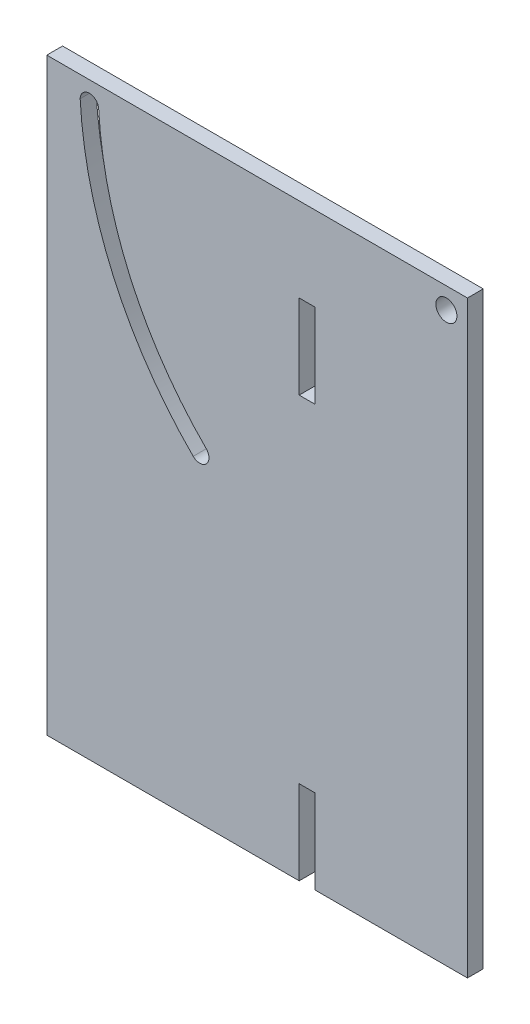
ISO-10303-21;
HEADER;
FILE_DESCRIPTION(('STEP AP214'),'2;1');
FILE_NAME('part.step','',(''),(''),'','','');
FILE_SCHEMA(('AUTOMOTIVE_DESIGN { 1 0 10303 214 1 1 1 1 }'));
ENDSEC;
DATA;
#1=APPLICATION_CONTEXT('core data for automotive mechanical design processes');
#2=APPLICATION_PROTOCOL_DEFINITION('international standard','automotive_design',2000,#1);
#3=PRODUCT_CONTEXT('',#1,'mechanical');
#4=PRODUCT('Part','Part','',(#3));
#5=PRODUCT_RELATED_PRODUCT_CATEGORY('part','',(#4));
#6=PRODUCT_DEFINITION_FORMATION('','',#4);
#7=PRODUCT_DEFINITION_CONTEXT('part definition',#1,'design');
#8=PRODUCT_DEFINITION('design','',#6,#7);
#9=PRODUCT_DEFINITION_SHAPE('','',#8);
#10=(LENGTH_UNIT() NAMED_UNIT(*) SI_UNIT(.MILLI.,.METRE.));
#11=(NAMED_UNIT(*) PLANE_ANGLE_UNIT() SI_UNIT($,.RADIAN.));
#12=(NAMED_UNIT(*) SI_UNIT($,.STERADIAN.) SOLID_ANGLE_UNIT());
#13=UNCERTAINTY_MEASURE_WITH_UNIT(LENGTH_MEASURE(1.E-05),#10,'distance_accuracy_value','');
#14=(GEOMETRIC_REPRESENTATION_CONTEXT(3) GLOBAL_UNCERTAINTY_ASSIGNED_CONTEXT((#13)) GLOBAL_UNIT_ASSIGNED_CONTEXT((#10,
#11,#12)) REPRESENTATION_CONTEXT('',''));
#15=CARTESIAN_POINT('',(0.,0.,0.));
#16=DIRECTION('',(0.,0.,1.));
#17=DIRECTION('',(1.,0.,0.));
#18=AXIS2_PLACEMENT_3D('',#15,#16,#17);
#19=CARTESIAN_POINT('',(0.,0.,4.7625));
#20=DIRECTION('',(0.,0.,-1.));
#21=DIRECTION('',(-1.,0.,0.));
#22=AXIS2_PLACEMENT_3D('',#19,#20,#21);
#23=PLANE('',#22);
#24=DIRECTION('',(0.,-1.,0.));
#25=VECTOR('',#24,1.);
#26=CARTESIAN_POINT('',(76.2,152.4,4.7625));
#27=LINE('',#26,#25);
#28=CARTESIAN_POINT('',(76.2,152.4,4.7625));
#29=VERTEX_POINT('',#28);
#30=CARTESIAN_POINT('',(76.2,127.,4.7625));
#31=VERTEX_POINT('',#30);
#32=EDGE_CURVE('E146',#29,#31,#27,.T.);
#33=ORIENTED_EDGE('',*,*,#32,.F.);
#34=DIRECTION('',(-1.,0.,0.));
#35=VECTOR('',#34,1.);
#36=CARTESIAN_POINT('',(76.2,152.4,4.7625));
#37=LINE('',#36,#35);
#38=CARTESIAN_POINT('',(80.9625,152.4,4.7625));
#39=VERTEX_POINT('',#38);
#40=EDGE_CURVE('E169',#39,#29,#37,.T.);
#41=ORIENTED_EDGE('',*,*,#40,.F.);
#42=DIRECTION('',(0.,1.,0.));
#43=VECTOR('',#42,1.);
#44=CARTESIAN_POINT('',(80.9625,152.4,4.7625));
#45=LINE('',#44,#43);
#46=CARTESIAN_POINT('',(80.9625,127.,4.7625));
#47=VERTEX_POINT('',#46);
#48=EDGE_CURVE('E167',#47,#39,#45,.T.);
#49=ORIENTED_EDGE('',*,*,#48,.F.);
#50=DIRECTION('',(1.,0.,0.));
#51=VECTOR('',#50,1.);
#52=CARTESIAN_POINT('',(76.2,127.,4.7625));
#53=LINE('',#52,#51);
#54=EDGE_CURVE('E154',#31,#47,#53,.T.);
#55=ORIENTED_EDGE('',*,*,#54,.F.);
#56=EDGE_LOOP('',(#33,#41,#49,#55));
#57=FACE_BOUND('',#56,.T.);
#58=DIRECTION('',(0.,-1.,0.));
#59=VECTOR('',#58,1.);
#60=CARTESIAN_POINT('',(0.,0.,4.7625));
#61=LINE('',#60,#59);
#62=CARTESIAN_POINT('',(0.,177.8,4.7625));
#63=VERTEX_POINT('',#62);
#64=CARTESIAN_POINT('',(0.,0.,4.7625));
#65=VERTEX_POINT('',#64);
#66=EDGE_CURVE('E216',#63,#65,#61,.T.);
#67=ORIENTED_EDGE('',*,*,#66,.T.);
#68=DIRECTION('',(1.,0.,0.));
#69=VECTOR('',#68,1.);
#70=CARTESIAN_POINT('',(0.,0.,4.7625));
#71=LINE('',#70,#69);
#72=CARTESIAN_POINT('',(76.2,0.,4.7625));
#73=VERTEX_POINT('',#72);
#74=EDGE_CURVE('E219',#65,#73,#71,.T.);
#75=ORIENTED_EDGE('',*,*,#74,.T.);
#76=DIRECTION('',(0.,1.,0.));
#77=VECTOR('',#76,1.);
#78=CARTESIAN_POINT('',(76.2,25.4,4.7625));
#79=LINE('',#78,#77);
#80=CARTESIAN_POINT('',(76.2,25.4,4.7625));
#81=VERTEX_POINT('',#80);
#82=EDGE_CURVE('E222',#73,#81,#79,.T.);
#83=ORIENTED_EDGE('',*,*,#82,.T.);
#84=DIRECTION('',(1.,0.,0.));
#85=VECTOR('',#84,1.);
#86=CARTESIAN_POINT('',(76.2,25.4,4.7625));
#87=LINE('',#86,#85);
#88=CARTESIAN_POINT('',(80.9625,25.4,4.7625));
#89=VERTEX_POINT('',#88);
#90=EDGE_CURVE('E224',#81,#89,#87,.T.);
#91=ORIENTED_EDGE('',*,*,#90,.T.);
#92=DIRECTION('',(0.,-1.,0.));
#93=VECTOR('',#92,1.);
#94=CARTESIAN_POINT('',(80.9625,25.4,4.7625));
#95=LINE('',#94,#93);
#96=CARTESIAN_POINT('',(80.9625,0.,4.7625));
#97=VERTEX_POINT('',#96);
#98=EDGE_CURVE('E226',#89,#97,#95,.T.);
#99=ORIENTED_EDGE('',*,*,#98,.T.);
#100=DIRECTION('',(1.,0.,0.));
#101=VECTOR('',#100,1.);
#102=CARTESIAN_POINT('',(80.9625,0.,4.7625));
#103=LINE('',#102,#101);
#104=CARTESIAN_POINT('',(127.,0.,4.7625));
#105=VERTEX_POINT('',#104);
#106=EDGE_CURVE('E228',#97,#105,#103,.T.);
#107=ORIENTED_EDGE('',*,*,#106,.T.);
#108=DIRECTION('',(0.,1.,0.));
#109=VECTOR('',#108,1.);
#110=CARTESIAN_POINT('',(127.,0.,4.7625));
#111=LINE('',#110,#109);
#112=CARTESIAN_POINT('',(127.,177.8,4.7625));
#113=VERTEX_POINT('',#112);
#114=EDGE_CURVE('E230',#105,#113,#111,.T.);
#115=ORIENTED_EDGE('',*,*,#114,.T.);
#116=DIRECTION('',(-1.,0.,0.));
#117=VECTOR('',#116,1.);
#118=CARTESIAN_POINT('',(0.,177.8,4.7625));
#119=LINE('',#118,#117);
#120=EDGE_CURVE('E232',#113,#63,#119,.T.);
#121=ORIENTED_EDGE('',*,*,#120,.T.);
#122=EDGE_LOOP('',(#67,#75,#83,#91,#99,#107,#115,#121));
#123=FACE_BOUND('',#122,.T.);
#124=CARTESIAN_POINT('',(12.8766311532659,171.45,4.7625));
#125=DIRECTION('',(0.,0.,1.));
#126=DIRECTION('',(1.,0.,0.));
#127=AXIS2_PLACEMENT_3D('',#124,#125,#126);
#128=CIRCLE('',#127,2.79832433293209);
#129=CARTESIAN_POINT('',(15.674955486198,171.45,4.7625));
#130=VERTEX_POINT('',#129);
#131=CARTESIAN_POINT('',(10.0783068203338,171.45,4.7625));
#132=VERTEX_POINT('',#131);
#133=EDGE_CURVE('E185',#130,#132,#128,.T.);
#134=ORIENTED_EDGE('',*,*,#133,.F.);
#135=CARTESIAN_POINT('',(127.,177.8,4.7625));
#136=DIRECTION('',(0.,0.,-1.));
#137=DIRECTION('',(1.,0.,0.));
#138=AXIS2_PLACEMENT_3D('',#135,#136,#137);
#139=CIRCLE('',#138,111.506);
#140=CARTESIAN_POINT('',(48.1533512570128,98.9533512570128,4.7625));
#141=VERTEX_POINT('',#140);
#142=EDGE_CURVE('E193',#141,#130,#139,.T.);
#143=ORIENTED_EDGE('',*,*,#142,.F.);
#144=CARTESIAN_POINT('',(46.1776949103776,96.9776949103776,4.7625));
#145=DIRECTION('',(0.,0.,1.));
#146=DIRECTION('',(-1.,0.,0.));
#147=AXIS2_PLACEMENT_3D('',#144,#145,#146);
#148=CIRCLE('',#147,2.794);
#149=CARTESIAN_POINT('',(44.2020385637424,95.0020385637424,4.7625));
#150=VERTEX_POINT('',#149);
#151=EDGE_CURVE('E190',#150,#141,#148,.T.);
#152=ORIENTED_EDGE('',*,*,#151,.F.);
#153=CARTESIAN_POINT('',(127.,177.8,4.7625));
#154=DIRECTION('',(0.,0.,1.));
#155=DIRECTION('',(1.,0.,0.));
#156=AXIS2_PLACEMENT_3D('',#153,#154,#155);
#157=CIRCLE('',#156,117.094);
#158=EDGE_CURVE('E187',#132,#150,#157,.T.);
#159=ORIENTED_EDGE('',*,*,#158,.F.);
#160=EDGE_LOOP('',(#134,#143,#152,#159));
#161=FACE_BOUND('',#160,.T.);
#162=CARTESIAN_POINT('',(120.65,171.45,4.7625));
#163=DIRECTION('',(0.,0.,1.));
#164=DIRECTION('',(1.,0.,0.));
#165=AXIS2_PLACEMENT_3D('',#162,#163,#164);
#166=CIRCLE('',#165,3.175);
#167=CARTESIAN_POINT('',(123.825,171.45,4.7625));
#168=VERTEX_POINT('',#167);
#169=EDGE_CURVE('E175',#168,#168,#166,.T.);
#170=ORIENTED_EDGE('',*,*,#169,.F.);
#171=EDGE_LOOP('',(#170));
#172=FACE_BOUND('',#171,.T.);
#173=ADVANCED_FACE('F33',(#57,#123,#161,#172),#23,.F.);
#174=CARTESIAN_POINT('',(0.,0.,0.));
#175=DIRECTION('',(0.,0.,-1.));
#176=DIRECTION('',(-1.,0.,0.));
#177=AXIS2_PLACEMENT_3D('',#174,#175,#176);
#178=PLANE('',#177);
#179=DIRECTION('',(-1.,0.,0.));
#180=VECTOR('',#179,1.);
#181=CARTESIAN_POINT('',(76.2,152.4,0.));
#182=LINE('',#181,#180);
#183=CARTESIAN_POINT('',(80.9625,152.4,0.));
#184=VERTEX_POINT('',#183);
#185=CARTESIAN_POINT('',(76.2,152.4,0.));
#186=VERTEX_POINT('',#185);
#187=EDGE_CURVE('E155',#184,#186,#182,.T.);
#188=ORIENTED_EDGE('',*,*,#187,.T.);
#189=DIRECTION('',(0.,-1.,0.));
#190=VECTOR('',#189,1.);
#191=CARTESIAN_POINT('',(76.2,152.4,0.));
#192=LINE('',#191,#190);
#193=CARTESIAN_POINT('',(76.2,127.,0.));
#194=VERTEX_POINT('',#193);
#195=EDGE_CURVE('E56',#186,#194,#192,.T.);
#196=ORIENTED_EDGE('',*,*,#195,.T.);
#197=DIRECTION('',(1.,0.,0.));
#198=VECTOR('',#197,1.);
#199=CARTESIAN_POINT('',(76.2,127.,0.));
#200=LINE('',#199,#198);
#201=CARTESIAN_POINT('',(80.9625,127.,0.));
#202=VERTEX_POINT('',#201);
#203=EDGE_CURVE('E161',#194,#202,#200,.T.);
#204=ORIENTED_EDGE('',*,*,#203,.T.);
#205=DIRECTION('',(0.,1.,0.));
#206=VECTOR('',#205,1.);
#207=CARTESIAN_POINT('',(80.9625,152.4,0.));
#208=LINE('',#207,#206);
#209=EDGE_CURVE('E177',#202,#184,#208,.T.);
#210=ORIENTED_EDGE('',*,*,#209,.T.);
#211=EDGE_LOOP('',(#188,#196,#204,#210));
#212=FACE_BOUND('',#211,.T.);
#213=DIRECTION('',(0.,-1.,0.));
#214=VECTOR('',#213,1.);
#215=CARTESIAN_POINT('',(0.,0.,0.));
#216=LINE('',#215,#214);
#217=CARTESIAN_POINT('',(0.,177.8,0.));
#218=VERTEX_POINT('',#217);
#219=CARTESIAN_POINT('',(0.,0.,0.));
#220=VERTEX_POINT('',#219);
#221=EDGE_CURVE('E215',#218,#220,#216,.T.);
#222=ORIENTED_EDGE('',*,*,#221,.F.);
#223=DIRECTION('',(-1.,0.,0.));
#224=VECTOR('',#223,1.);
#225=CARTESIAN_POINT('',(0.,177.8,0.));
#226=LINE('',#225,#224);
#227=CARTESIAN_POINT('',(127.,177.8,0.));
#228=VERTEX_POINT('',#227);
#229=EDGE_CURVE('E220',#228,#218,#226,.T.);
#230=ORIENTED_EDGE('',*,*,#229,.F.);
#231=DIRECTION('',(0.,1.,0.));
#232=VECTOR('',#231,1.);
#233=CARTESIAN_POINT('',(127.,0.,0.));
#234=LINE('',#233,#232);
#235=CARTESIAN_POINT('',(127.,0.,0.));
#236=VERTEX_POINT('',#235);
#237=EDGE_CURVE('E247',#236,#228,#234,.T.);
#238=ORIENTED_EDGE('',*,*,#237,.F.);
#239=DIRECTION('',(1.,0.,0.));
#240=VECTOR('',#239,1.);
#241=CARTESIAN_POINT('',(80.9625,0.,0.));
#242=LINE('',#241,#240);
#243=CARTESIAN_POINT('',(80.9625,0.,0.));
#244=VERTEX_POINT('',#243);
#245=EDGE_CURVE('E245',#244,#236,#242,.T.);
#246=ORIENTED_EDGE('',*,*,#245,.F.);
#247=DIRECTION('',(0.,-1.,0.));
#248=VECTOR('',#247,1.);
#249=CARTESIAN_POINT('',(80.9625,25.4,0.));
#250=LINE('',#249,#248);
#251=CARTESIAN_POINT('',(80.9625,25.4,0.));
#252=VERTEX_POINT('',#251);
#253=EDGE_CURVE('E243',#252,#244,#250,.T.);
#254=ORIENTED_EDGE('',*,*,#253,.F.);
#255=DIRECTION('',(1.,0.,0.));
#256=VECTOR('',#255,1.);
#257=CARTESIAN_POINT('',(76.2,25.4,0.));
#258=LINE('',#257,#256);
#259=CARTESIAN_POINT('',(76.2,25.4,0.));
#260=VERTEX_POINT('',#259);
#261=EDGE_CURVE('E241',#260,#252,#258,.T.);
#262=ORIENTED_EDGE('',*,*,#261,.F.);
#263=DIRECTION('',(0.,1.,0.));
#264=VECTOR('',#263,1.);
#265=CARTESIAN_POINT('',(76.2,25.4,0.));
#266=LINE('',#265,#264);
#267=CARTESIAN_POINT('',(76.2,0.,0.));
#268=VERTEX_POINT('',#267);
#269=EDGE_CURVE('E239',#268,#260,#266,.T.);
#270=ORIENTED_EDGE('',*,*,#269,.F.);
#271=DIRECTION('',(1.,0.,0.));
#272=VECTOR('',#271,1.);
#273=CARTESIAN_POINT('',(0.,0.,0.));
#274=LINE('',#273,#272);
#275=EDGE_CURVE('E237',#220,#268,#274,.T.);
#276=ORIENTED_EDGE('',*,*,#275,.F.);
#277=EDGE_LOOP('',(#222,#230,#238,#246,#254,#262,#270,#276));
#278=FACE_BOUND('',#277,.T.);
#279=CARTESIAN_POINT('',(127.,177.8,0.));
#280=DIRECTION('',(0.,0.,-1.));
#281=DIRECTION('',(1.,0.,0.));
#282=AXIS2_PLACEMENT_3D('',#279,#280,#281);
#283=CIRCLE('',#282,111.506);
#284=CARTESIAN_POINT('',(48.1533512570128,98.9533512570128,0.));
#285=VERTEX_POINT('',#284);
#286=CARTESIAN_POINT('',(15.674955486198,171.45,0.));
#287=VERTEX_POINT('',#286);
#288=EDGE_CURVE('E188',#285,#287,#283,.T.);
#289=ORIENTED_EDGE('',*,*,#288,.T.);
#290=CARTESIAN_POINT('',(12.8766311532659,171.45,0.));
#291=DIRECTION('',(0.,0.,1.));
#292=DIRECTION('',(1.,0.,0.));
#293=AXIS2_PLACEMENT_3D('',#290,#291,#292);
#294=CIRCLE('',#293,2.79832433293209);
#295=CARTESIAN_POINT('',(10.0783068203338,171.45,0.));
#296=VERTEX_POINT('',#295);
#297=EDGE_CURVE('E162',#287,#296,#294,.T.);
#298=ORIENTED_EDGE('',*,*,#297,.T.);
#299=CARTESIAN_POINT('',(127.,177.8,0.));
#300=DIRECTION('',(0.,0.,1.));
#301=DIRECTION('',(1.,0.,0.));
#302=AXIS2_PLACEMENT_3D('',#299,#300,#301);
#303=CIRCLE('',#302,117.094);
#304=CARTESIAN_POINT('',(44.2020385637424,95.0020385637424,0.));
#305=VERTEX_POINT('',#304);
#306=EDGE_CURVE('E198',#296,#305,#303,.T.);
#307=ORIENTED_EDGE('',*,*,#306,.T.);
#308=CARTESIAN_POINT('',(46.1776949103776,96.9776949103776,0.));
#309=DIRECTION('',(0.,0.,1.));
#310=DIRECTION('',(-1.,0.,0.));
#311=AXIS2_PLACEMENT_3D('',#308,#309,#310);
#312=CIRCLE('',#311,2.794);
#313=EDGE_CURVE('E201',#305,#285,#312,.T.);
#314=ORIENTED_EDGE('',*,*,#313,.T.);
#315=EDGE_LOOP('',(#289,#298,#307,#314));
#316=FACE_BOUND('',#315,.T.);
#317=CARTESIAN_POINT('',(120.65,171.45,0.));
#318=DIRECTION('',(0.,0.,1.));
#319=DIRECTION('',(1.,0.,0.));
#320=AXIS2_PLACEMENT_3D('',#317,#318,#319);
#321=CIRCLE('',#320,3.175);
#322=CARTESIAN_POINT('',(123.825,171.45,0.));
#323=VERTEX_POINT('',#322);
#324=EDGE_CURVE('E355',#323,#323,#321,.T.);
#325=ORIENTED_EDGE('',*,*,#324,.T.);
#326=EDGE_LOOP('',(#325));
#327=FACE_BOUND('',#326,.T.);
#328=ADVANCED_FACE('F277',(#212,#278,#316,#327),#178,.T.);
#329=CARTESIAN_POINT('',(0.,0.,4.7625));
#330=DIRECTION('',(1.,0.,0.));
#331=DIRECTION('',(0.,0.,-1.));
#332=AXIS2_PLACEMENT_3D('',#329,#330,#331);
#333=PLANE('',#332);
#334=ORIENTED_EDGE('',*,*,#221,.T.);
#335=DIRECTION('',(0.,0.,-1.));
#336=VECTOR('',#335,1.);
#337=CARTESIAN_POINT('',(0.,0.,4.7625));
#338=LINE('',#337,#336);
#339=EDGE_CURVE('E11',#65,#220,#338,.T.);
#340=ORIENTED_EDGE('',*,*,#339,.F.);
#341=ORIENTED_EDGE('',*,*,#66,.F.);
#342=DIRECTION('',(0.,0.,-1.));
#343=VECTOR('',#342,1.);
#344=CARTESIAN_POINT('',(0.,177.8,4.7625));
#345=LINE('',#344,#343);
#346=EDGE_CURVE('E234',#63,#218,#345,.T.);
#347=ORIENTED_EDGE('',*,*,#346,.T.);
#348=EDGE_LOOP('',(#334,#340,#341,#347));
#349=FACE_BOUND('',#348,.T.);
#350=ADVANCED_FACE('F35',(#349),#333,.F.);
#351=CARTESIAN_POINT('',(0.,0.,4.7625));
#352=DIRECTION('',(0.,1.,0.));
#353=DIRECTION('',(0.,0.,1.));
#354=AXIS2_PLACEMENT_3D('',#351,#352,#353);
#355=PLANE('',#354);
#356=ORIENTED_EDGE('',*,*,#275,.T.);
#357=DIRECTION('',(0.,0.,-1.));
#358=VECTOR('',#357,1.);
#359=CARTESIAN_POINT('',(76.2,0.,4.7625));
#360=LINE('',#359,#358);
#361=EDGE_CURVE('E41',#73,#268,#360,.T.);
#362=ORIENTED_EDGE('',*,*,#361,.F.);
#363=ORIENTED_EDGE('',*,*,#74,.F.);
#364=ORIENTED_EDGE('',*,*,#339,.T.);
#365=EDGE_LOOP('',(#356,#362,#363,#364));
#366=FACE_BOUND('',#365,.T.);
#367=ADVANCED_FACE('F294',(#366),#355,.F.);
#368=CARTESIAN_POINT('',(76.2,25.4,4.7625));
#369=DIRECTION('',(-1.,0.,0.));
#370=DIRECTION('',(0.,0.,1.));
#371=AXIS2_PLACEMENT_3D('',#368,#369,#370);
#372=PLANE('',#371);
#373=ORIENTED_EDGE('',*,*,#269,.T.);
#374=DIRECTION('',(0.,0.,-1.));
#375=VECTOR('',#374,1.);
#376=CARTESIAN_POINT('',(76.2,25.4,4.7625));
#377=LINE('',#376,#375);
#378=EDGE_CURVE('E264',#81,#260,#377,.T.);
#379=ORIENTED_EDGE('',*,*,#378,.F.);
#380=ORIENTED_EDGE('',*,*,#82,.F.);
#381=ORIENTED_EDGE('',*,*,#361,.T.);
#382=EDGE_LOOP('',(#373,#379,#380,#381));
#383=FACE_BOUND('',#382,.T.);
#384=ADVANCED_FACE('F271',(#383),#372,.F.);
#385=CARTESIAN_POINT('',(76.2,25.4,4.7625));
#386=DIRECTION('',(0.,1.,0.));
#387=DIRECTION('',(0.,0.,1.));
#388=AXIS2_PLACEMENT_3D('',#385,#386,#387);
#389=PLANE('',#388);
#390=ORIENTED_EDGE('',*,*,#261,.T.);
#391=DIRECTION('',(0.,0.,-1.));
#392=VECTOR('',#391,1.);
#393=CARTESIAN_POINT('',(80.9625,25.4,4.7625));
#394=LINE('',#393,#392);
#395=EDGE_CURVE('E261',#89,#252,#394,.T.);
#396=ORIENTED_EDGE('',*,*,#395,.F.);
#397=ORIENTED_EDGE('',*,*,#90,.F.);
#398=ORIENTED_EDGE('',*,*,#378,.T.);
#399=EDGE_LOOP('',(#390,#396,#397,#398));
#400=FACE_BOUND('',#399,.T.);
#401=ADVANCED_FACE('F283',(#400),#389,.F.);
#402=CARTESIAN_POINT('',(80.9625,25.4,4.7625));
#403=DIRECTION('',(1.,0.,0.));
#404=DIRECTION('',(0.,0.,-1.));
#405=AXIS2_PLACEMENT_3D('',#402,#403,#404);
#406=PLANE('',#405);
#407=ORIENTED_EDGE('',*,*,#253,.T.);
#408=DIRECTION('',(0.,0.,-1.));
#409=VECTOR('',#408,1.);
#410=CARTESIAN_POINT('',(80.9625,0.,4.7625));
#411=LINE('',#410,#409);
#412=EDGE_CURVE('E258',#97,#244,#411,.T.);
#413=ORIENTED_EDGE('',*,*,#412,.F.);
#414=ORIENTED_EDGE('',*,*,#98,.F.);
#415=ORIENTED_EDGE('',*,*,#395,.T.);
#416=EDGE_LOOP('',(#407,#413,#414,#415));
#417=FACE_BOUND('',#416,.T.);
#418=ADVANCED_FACE('F287',(#417),#406,.F.);
#419=CARTESIAN_POINT('',(80.9625,0.,4.7625));
#420=DIRECTION('',(0.,1.,0.));
#421=DIRECTION('',(0.,0.,1.));
#422=AXIS2_PLACEMENT_3D('',#419,#420,#421);
#423=PLANE('',#422);
#424=ORIENTED_EDGE('',*,*,#245,.T.);
#425=DIRECTION('',(0.,0.,-1.));
#426=VECTOR('',#425,1.);
#427=CARTESIAN_POINT('',(127.,0.,4.7625));
#428=LINE('',#427,#426);
#429=EDGE_CURVE('E255',#105,#236,#428,.T.);
#430=ORIENTED_EDGE('',*,*,#429,.F.);
#431=ORIENTED_EDGE('',*,*,#106,.F.);
#432=ORIENTED_EDGE('',*,*,#412,.T.);
#433=EDGE_LOOP('',(#424,#430,#431,#432));
#434=FACE_BOUND('',#433,.T.);
#435=ADVANCED_FACE('F307',(#434),#423,.F.);
#436=CARTESIAN_POINT('',(127.,0.,4.7625));
#437=DIRECTION('',(-1.,0.,0.));
#438=DIRECTION('',(0.,0.,1.));
#439=AXIS2_PLACEMENT_3D('',#436,#437,#438);
#440=PLANE('',#439);
#441=ORIENTED_EDGE('',*,*,#237,.T.);
#442=DIRECTION('',(0.,0.,-1.));
#443=VECTOR('',#442,1.);
#444=CARTESIAN_POINT('',(127.,177.8,4.7625));
#445=LINE('',#444,#443);
#446=EDGE_CURVE('E252',#113,#228,#445,.T.);
#447=ORIENTED_EDGE('',*,*,#446,.F.);
#448=ORIENTED_EDGE('',*,*,#114,.F.);
#449=ORIENTED_EDGE('',*,*,#429,.T.);
#450=EDGE_LOOP('',(#441,#447,#448,#449));
#451=FACE_BOUND('',#450,.T.);
#452=ADVANCED_FACE('F305',(#451),#440,.F.);
#453=CARTESIAN_POINT('',(0.,177.8,4.7625));
#454=DIRECTION('',(0.,-1.,0.));
#455=DIRECTION('',(0.,0.,-1.));
#456=AXIS2_PLACEMENT_3D('',#453,#454,#455);
#457=PLANE('',#456);
#458=ORIENTED_EDGE('',*,*,#229,.T.);
#459=ORIENTED_EDGE('',*,*,#346,.F.);
#460=ORIENTED_EDGE('',*,*,#120,.F.);
#461=ORIENTED_EDGE('',*,*,#446,.T.);
#462=EDGE_LOOP('',(#458,#459,#460,#461));
#463=FACE_BOUND('',#462,.T.);
#464=ADVANCED_FACE('F300',(#463),#457,.F.);
#465=CARTESIAN_POINT('',(12.8766311532659,171.45,4.7625));
#466=DIRECTION('',(0.,0.,-1.));
#467=DIRECTION('',(-1.,0.,0.));
#468=AXIS2_PLACEMENT_3D('',#465,#466,#467);
#469=CYLINDRICAL_SURFACE('',#468,2.79832433293209);
#470=ORIENTED_EDGE('',*,*,#297,.F.);
#471=DIRECTION('',(0.,0.,-1.));
#472=VECTOR('',#471,1.);
#473=CARTESIAN_POINT('',(15.674955486198,171.45,4.7625));
#474=LINE('',#473,#472);
#475=EDGE_CURVE('E195',#130,#287,#474,.T.);
#476=ORIENTED_EDGE('',*,*,#475,.F.);
#477=ORIENTED_EDGE('',*,*,#133,.T.);
#478=DIRECTION('',(0.,0.,-1.));
#479=VECTOR('',#478,1.);
#480=CARTESIAN_POINT('',(10.0783068203338,171.45,4.7625));
#481=LINE('',#480,#479);
#482=EDGE_CURVE('E212',#132,#296,#481,.T.);
#483=ORIENTED_EDGE('',*,*,#482,.T.);
#484=EDGE_LOOP('',(#470,#476,#477,#483));
#485=FACE_BOUND('',#484,.T.);
#486=ADVANCED_FACE('F324',(#485),#469,.F.);
#487=CARTESIAN_POINT('',(127.,177.8,4.7625));
#488=DIRECTION('',(0.,0.,-1.));
#489=DIRECTION('',(-1.,0.,0.));
#490=AXIS2_PLACEMENT_3D('',#487,#488,#489);
#491=CYLINDRICAL_SURFACE('',#490,117.094);
#492=ORIENTED_EDGE('',*,*,#306,.F.);
#493=ORIENTED_EDGE('',*,*,#482,.F.);
#494=ORIENTED_EDGE('',*,*,#158,.T.);
#495=DIRECTION('',(0.,0.,-1.));
#496=VECTOR('',#495,1.);
#497=CARTESIAN_POINT('',(44.2020385637424,95.0020385637424,4.7625));
#498=LINE('',#497,#496);
#499=EDGE_CURVE('E210',#150,#305,#498,.T.);
#500=ORIENTED_EDGE('',*,*,#499,.T.);
#501=EDGE_LOOP('',(#492,#493,#494,#500));
#502=FACE_BOUND('',#501,.T.);
#503=ADVANCED_FACE('F331',(#502),#491,.F.);
#504=CARTESIAN_POINT('',(46.1776949103776,96.9776949103776,4.7625));
#505=DIRECTION('',(0.,0.,-1.));
#506=DIRECTION('',(-1.,0.,0.));
#507=AXIS2_PLACEMENT_3D('',#504,#505,#506);
#508=CYLINDRICAL_SURFACE('',#507,2.794);
#509=ORIENTED_EDGE('',*,*,#313,.F.);
#510=ORIENTED_EDGE('',*,*,#499,.F.);
#511=ORIENTED_EDGE('',*,*,#151,.T.);
#512=DIRECTION('',(0.,0.,-1.));
#513=VECTOR('',#512,1.);
#514=CARTESIAN_POINT('',(48.1533512570128,98.9533512570128,4.7625));
#515=LINE('',#514,#513);
#516=EDGE_CURVE('E208',#141,#285,#515,.T.);
#517=ORIENTED_EDGE('',*,*,#516,.T.);
#518=EDGE_LOOP('',(#509,#510,#511,#517));
#519=FACE_BOUND('',#518,.T.);
#520=ADVANCED_FACE('F336',(#519),#508,.F.);
#521=CARTESIAN_POINT('',(127.,177.8,4.7625));
#522=DIRECTION('',(0.,0.,-1.));
#523=DIRECTION('',(-1.,0.,0.));
#524=AXIS2_PLACEMENT_3D('',#521,#522,#523);
#525=CYLINDRICAL_SURFACE('',#524,111.506);
#526=ORIENTED_EDGE('',*,*,#288,.F.);
#527=ORIENTED_EDGE('',*,*,#516,.F.);
#528=ORIENTED_EDGE('',*,*,#142,.T.);
#529=ORIENTED_EDGE('',*,*,#475,.T.);
#530=EDGE_LOOP('',(#526,#527,#528,#529));
#531=FACE_BOUND('',#530,.T.);
#532=ADVANCED_FACE('F343',(#531),#525,.T.);
#533=CARTESIAN_POINT('',(76.2,152.4,4.7625));
#534=DIRECTION('',(1.,0.,0.));
#535=DIRECTION('',(0.,0.,-1.));
#536=AXIS2_PLACEMENT_3D('',#533,#534,#535);
#537=PLANE('',#536);
#538=ORIENTED_EDGE('',*,*,#195,.F.);
#539=DIRECTION('',(0.,0.,-1.));
#540=VECTOR('',#539,1.);
#541=CARTESIAN_POINT('',(76.2,152.4,4.7625));
#542=LINE('',#541,#540);
#543=EDGE_CURVE('E150',#29,#186,#542,.T.);
#544=ORIENTED_EDGE('',*,*,#543,.F.);
#545=ORIENTED_EDGE('',*,*,#32,.T.);
#546=DIRECTION('',(0.,0.,-1.));
#547=VECTOR('',#546,1.);
#548=CARTESIAN_POINT('',(76.2,127.,4.7625));
#549=LINE('',#548,#547);
#550=EDGE_CURVE('E149',#31,#194,#549,.T.);
#551=ORIENTED_EDGE('',*,*,#550,.T.);
#552=EDGE_LOOP('',(#538,#544,#545,#551));
#553=FACE_BOUND('',#552,.T.);
#554=ADVANCED_FACE('F148',(#553),#537,.T.);
#555=CARTESIAN_POINT('',(76.2,127.,4.7625));
#556=DIRECTION('',(0.,1.,0.));
#557=DIRECTION('',(0.,0.,1.));
#558=AXIS2_PLACEMENT_3D('',#555,#556,#557);
#559=PLANE('',#558);
#560=ORIENTED_EDGE('',*,*,#203,.F.);
#561=ORIENTED_EDGE('',*,*,#550,.F.);
#562=ORIENTED_EDGE('',*,*,#54,.T.);
#563=DIRECTION('',(0.,0.,-1.));
#564=VECTOR('',#563,1.);
#565=CARTESIAN_POINT('',(80.9625,127.,4.7625));
#566=LINE('',#565,#564);
#567=EDGE_CURVE('E163',#47,#202,#566,.T.);
#568=ORIENTED_EDGE('',*,*,#567,.T.);
#569=EDGE_LOOP('',(#560,#561,#562,#568));
#570=FACE_BOUND('',#569,.T.);
#571=ADVANCED_FACE('F158',(#570),#559,.T.);
#572=CARTESIAN_POINT('',(80.9625,152.4,4.7625));
#573=DIRECTION('',(-1.,0.,0.));
#574=DIRECTION('',(0.,0.,1.));
#575=AXIS2_PLACEMENT_3D('',#572,#573,#574);
#576=PLANE('',#575);
#577=ORIENTED_EDGE('',*,*,#209,.F.);
#578=ORIENTED_EDGE('',*,*,#567,.F.);
#579=ORIENTED_EDGE('',*,*,#48,.T.);
#580=DIRECTION('',(0.,0.,-1.));
#581=VECTOR('',#580,1.);
#582=CARTESIAN_POINT('',(80.9625,152.4,4.7625));
#583=LINE('',#582,#581);
#584=EDGE_CURVE('E48',#39,#184,#583,.T.);
#585=ORIENTED_EDGE('',*,*,#584,.T.);
#586=EDGE_LOOP('',(#577,#578,#579,#585));
#587=FACE_BOUND('',#586,.T.);
#588=ADVANCED_FACE('F367',(#587),#576,.T.);
#589=CARTESIAN_POINT('',(76.2,152.4,4.7625));
#590=DIRECTION('',(0.,-1.,0.));
#591=DIRECTION('',(0.,0.,-1.));
#592=AXIS2_PLACEMENT_3D('',#589,#590,#591);
#593=PLANE('',#592);
#594=ORIENTED_EDGE('',*,*,#187,.F.);
#595=ORIENTED_EDGE('',*,*,#584,.F.);
#596=ORIENTED_EDGE('',*,*,#40,.T.);
#597=ORIENTED_EDGE('',*,*,#543,.T.);
#598=EDGE_LOOP('',(#594,#595,#596,#597));
#599=FACE_BOUND('',#598,.T.);
#600=ADVANCED_FACE('F362',(#599),#593,.T.);
#601=CARTESIAN_POINT('',(120.65,171.45,4.7625));
#602=DIRECTION('',(0.,0.,-1.));
#603=DIRECTION('',(-1.,0.,0.));
#604=AXIS2_PLACEMENT_3D('',#601,#602,#603);
#605=CYLINDRICAL_SURFACE('',#604,3.175);
#606=ORIENTED_EDGE('',*,*,#169,.T.);
#607=EDGE_LOOP('',(#606));
#608=FACE_BOUND('',#607,.T.);
#609=ORIENTED_EDGE('',*,*,#324,.F.);
#610=EDGE_LOOP('',(#609));
#611=FACE_BOUND('',#610,.T.);
#612=ADVANCED_FACE('F360',(#608,#611),#605,.F.);
#613=CLOSED_SHELL('',(#173,#328,#350,#367,#384,#401,#418,#435,#452,#464,#486,#503,#520,#532,
#554,#571,#588,#600,#612));
#614=MANIFOLD_SOLID_BREP('B2',#613);
#615=ADVANCED_BREP_SHAPE_REPRESENTATION('',(#18,#614),#14);
#616=SHAPE_DEFINITION_REPRESENTATION(#9,#615);
ENDSEC;
END-ISO-10303-21;
